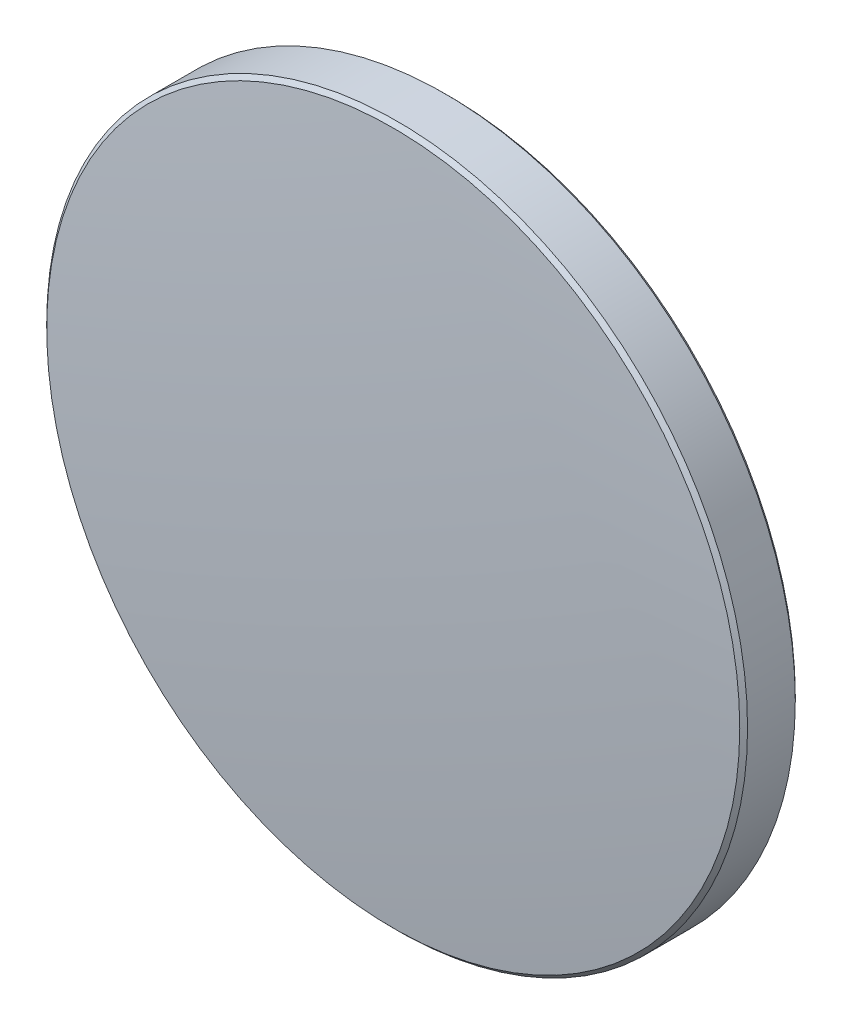
ISO-10303-21;
HEADER;
FILE_DESCRIPTION(('STEP AP214'),'2;1');
FILE_NAME('part.step','',(''),(''),'','','');
FILE_SCHEMA(('AUTOMOTIVE_DESIGN { 1 0 10303 214 1 1 1 1 }'));
ENDSEC;
DATA;
#1=APPLICATION_CONTEXT('core data for automotive mechanical design processes');
#2=APPLICATION_PROTOCOL_DEFINITION('international standard','automotive_design',2000,#1);
#3=PRODUCT_CONTEXT('',#1,'mechanical');
#4=PRODUCT('Part','Part','',(#3));
#5=PRODUCT_RELATED_PRODUCT_CATEGORY('part','',(#4));
#6=PRODUCT_DEFINITION_FORMATION('','',#4);
#7=PRODUCT_DEFINITION_CONTEXT('part definition',#1,'design');
#8=PRODUCT_DEFINITION('design','',#6,#7);
#9=PRODUCT_DEFINITION_SHAPE('','',#8);
#10=(LENGTH_UNIT() NAMED_UNIT(*) SI_UNIT(.MILLI.,.METRE.));
#11=(NAMED_UNIT(*) PLANE_ANGLE_UNIT() SI_UNIT($,.RADIAN.));
#12=(NAMED_UNIT(*) SI_UNIT($,.STERADIAN.) SOLID_ANGLE_UNIT());
#13=UNCERTAINTY_MEASURE_WITH_UNIT(LENGTH_MEASURE(1.E-05),#10,'distance_accuracy_value','');
#14=(GEOMETRIC_REPRESENTATION_CONTEXT(3) GLOBAL_UNCERTAINTY_ASSIGNED_CONTEXT((#13)) GLOBAL_UNIT_ASSIGNED_CONTEXT((#10,
#11,#12)) REPRESENTATION_CONTEXT('',''));
#15=CARTESIAN_POINT('',(0.,0.,0.));
#16=DIRECTION('',(0.,0.,1.));
#17=DIRECTION('',(1.,0.,0.));
#18=AXIS2_PLACEMENT_3D('',#15,#16,#17);
#19=CARTESIAN_POINT('',(-0.0482476397285396,0.,-136.724991567038));
#20=DIRECTION('',(0.,-1.,0.));
#21=DIRECTION('',(1.,0.,0.));
#22=AXIS2_PLACEMENT_3D('',#19,#20,#21);
#23=CIRCLE('',#22,138.02);
#24=TRIMMED_CURVE('',#23,(PARAMETER_VALUE(-1.57044675687234)),
(PARAMETER_VALUE(1.57044675687234)),.T.,.PARAMETER.);
#25=CARTESIAN_POINT('',(0.,0.,-136.724991567038));
#26=DIRECTION('',(0.,0.,1.));
#27=AXIS1_PLACEMENT('',#25,#26);
#28=SURFACE_OF_REVOLUTION('',#24,#27);
#29=CARTESIAN_POINT('',(0.,0.,1.295));
#30=VERTEX_POINT('',#29);
#31=VERTEX_LOOP('',#30);
#32=FACE_BOUND('',#31,.T.);
#33=CARTESIAN_POINT('',(0.,0.,0.718045110190052));
#34=DIRECTION('',(0.,0.,1.));
#35=DIRECTION('',(1.,0.,0.));
#36=AXIS2_PLACEMENT_3D('',#33,#34,#35);
#37=CIRCLE('',#36,12.5585786437627);
#38=CARTESIAN_POINT('',(12.5585786437627,0.,0.718045110190052));
#39=VERTEX_POINT('',#38);
#40=EDGE_CURVE('E29',#39,#39,#37,.T.);
#41=ORIENTED_EDGE('',*,*,#40,.T.);
#42=EDGE_LOOP('',(#41));
#43=FACE_BOUND('',#42,.T.);
#44=ADVANCED_FACE('F15',(#32,#43),#28,.T.);
#45=CARTESIAN_POINT('',(0.,0.,-1.295));
#46=DIRECTION('',(0.,0.,1.));
#47=DIRECTION('',(1.,0.,0.));
#48=AXIS2_PLACEMENT_3D('',#45,#46,#47);
#49=PLANE('',#48);
#50=CARTESIAN_POINT('',(0.,0.,-1.295));
#51=DIRECTION('',(0.,0.,1.));
#52=DIRECTION('',(1.,0.,0.));
#53=AXIS2_PLACEMENT_3D('',#50,#51,#52);
#54=CIRCLE('',#53,12.5585786437627);
#55=CARTESIAN_POINT('',(12.5585786437627,0.,-1.295));
#56=VERTEX_POINT('',#55);
#57=EDGE_CURVE('E10',#56,#56,#54,.T.);
#58=ORIENTED_EDGE('',*,*,#57,.F.);
#59=EDGE_LOOP('',(#58));
#60=FACE_BOUND('',#59,.T.);
#61=ADVANCED_FACE('F26',(#60),#49,.F.);
#62=CARTESIAN_POINT('',(0.,0.,-1.295));
#63=DIRECTION('',(0.,0.,1.));
#64=DIRECTION('',(1.,0.,0.));
#65=AXIS2_PLACEMENT_3D('',#62,#63,#64);
#66=CONICAL_SURFACE('',#65,12.5585786437627,0.785398163397448);
#67=CARTESIAN_POINT('',(0.,0.,-1.15357864376269));
#68=DIRECTION('',(0.,0.,1.));
#69=DIRECTION('',(1.,0.,0.));
#70=AXIS2_PLACEMENT_3D('',#67,#68,#69);
#71=CIRCLE('',#70,12.7);
#72=CARTESIAN_POINT('',(12.7,0.,-1.15357864376269));
#73=VERTEX_POINT('',#72);
#74=EDGE_CURVE('E21',#73,#73,#71,.T.);
#75=ORIENTED_EDGE('',*,*,#74,.F.);
#76=EDGE_LOOP('',(#75));
#77=FACE_BOUND('',#76,.T.);
#78=ORIENTED_EDGE('',*,*,#57,.T.);
#79=EDGE_LOOP('',(#78));
#80=FACE_BOUND('',#79,.T.);
#81=ADVANCED_FACE('F40',(#77,#80),#66,.T.);
#82=CARTESIAN_POINT('',(0.,0.,16.0135549997621));
#83=DIRECTION('',(0.,0.,1.));
#84=DIRECTION('',(1.,0.,0.));
#85=AXIS2_PLACEMENT_3D('',#82,#83,#84);
#86=CYLINDRICAL_SURFACE('',#85,12.7);
#87=CARTESIAN_POINT('',(0.,0.,0.576623753952742));
#88=DIRECTION('',(0.,0.,1.));
#89=DIRECTION('',(1.,0.,0.));
#90=AXIS2_PLACEMENT_3D('',#87,#88,#89);
#91=CIRCLE('',#90,12.7);
#92=CARTESIAN_POINT('',(12.7,0.,0.576623753952742));
#93=VERTEX_POINT('',#92);
#94=EDGE_CURVE('E31',#93,#93,#91,.T.);
#95=ORIENTED_EDGE('',*,*,#94,.F.);
#96=EDGE_LOOP('',(#95));
#97=FACE_BOUND('',#96,.T.);
#98=ORIENTED_EDGE('',*,*,#74,.T.);
#99=EDGE_LOOP('',(#98));
#100=FACE_BOUND('',#99,.T.);
#101=ADVANCED_FACE('F38',(#97,#100),#86,.T.);
#102=CARTESIAN_POINT('',(0.,0.,0.576623753952742));
#103=DIRECTION('',(0.,0.,-1.));
#104=DIRECTION('',(-1.,0.,0.));
#105=AXIS2_PLACEMENT_3D('',#102,#103,#104);
#106=CONICAL_SURFACE('',#105,12.7,0.785398163397448);
#107=ORIENTED_EDGE('',*,*,#40,.F.);
#108=EDGE_LOOP('',(#107));
#109=FACE_BOUND('',#108,.T.);
#110=ORIENTED_EDGE('',*,*,#94,.T.);
#111=EDGE_LOOP('',(#110));
#112=FACE_BOUND('',#111,.T.);
#113=ADVANCED_FACE('F53',(#109,#112),#106,.T.);
#114=CLOSED_SHELL('',(#44,#61,#81,#101,#113));
#115=MANIFOLD_SOLID_BREP('B1',#114);
#116=ADVANCED_BREP_SHAPE_REPRESENTATION('',(#18,#115),#14);
#117=SHAPE_DEFINITION_REPRESENTATION(#9,#116);
ENDSEC;
END-ISO-10303-21;
